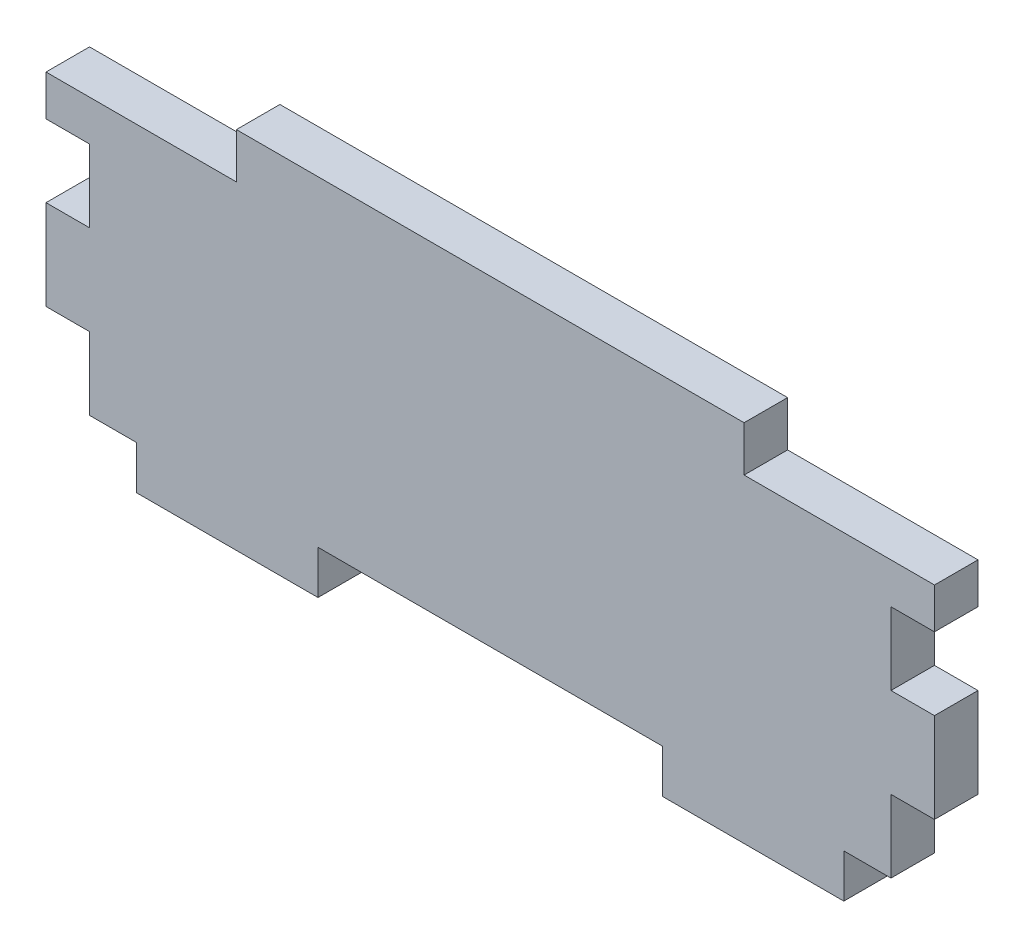
ISO-10303-21;
HEADER;
FILE_DESCRIPTION(('STEP AP214'),'2;1');
FILE_NAME('part.step','',(''),(''),'','','');
FILE_SCHEMA(('AUTOMOTIVE_DESIGN { 1 0 10303 214 1 1 1 1 }'));
ENDSEC;
DATA;
#1=APPLICATION_CONTEXT('core data for automotive mechanical design processes');
#2=APPLICATION_PROTOCOL_DEFINITION('international standard','automotive_design',2000,#1);
#3=PRODUCT_CONTEXT('',#1,'mechanical');
#4=PRODUCT('Part','Part','',(#3));
#5=PRODUCT_RELATED_PRODUCT_CATEGORY('part','',(#4));
#6=PRODUCT_DEFINITION_FORMATION('','',#4);
#7=PRODUCT_DEFINITION_CONTEXT('part definition',#1,'design');
#8=PRODUCT_DEFINITION('design','',#6,#7);
#9=PRODUCT_DEFINITION_SHAPE('','',#8);
#10=(LENGTH_UNIT() NAMED_UNIT(*) SI_UNIT(.MILLI.,.METRE.));
#11=(NAMED_UNIT(*) PLANE_ANGLE_UNIT() SI_UNIT($,.RADIAN.));
#12=(NAMED_UNIT(*) SI_UNIT($,.STERADIAN.) SOLID_ANGLE_UNIT());
#13=UNCERTAINTY_MEASURE_WITH_UNIT(LENGTH_MEASURE(1.E-05),#10,'distance_accuracy_value','');
#14=(GEOMETRIC_REPRESENTATION_CONTEXT(3) GLOBAL_UNCERTAINTY_ASSIGNED_CONTEXT((#13)) GLOBAL_UNIT_ASSIGNED_CONTEXT((#10,
#11,#12)) REPRESENTATION_CONTEXT('',''));
#15=CARTESIAN_POINT('',(0.,0.,0.));
#16=DIRECTION('',(0.,0.,1.));
#17=DIRECTION('',(1.,0.,0.));
#18=AXIS2_PLACEMENT_3D('',#15,#16,#17);
#19=CARTESIAN_POINT('',(3.048,16.1036,3.048));
#20=DIRECTION('',(-1.,0.,0.));
#21=DIRECTION('',(0.,0.,1.));
#22=AXIS2_PLACEMENT_3D('',#19,#20,#21);
#23=PLANE('',#22);
#24=DIRECTION('',(0.,1.,0.));
#25=VECTOR('',#24,1.);
#26=CARTESIAN_POINT('',(3.048,16.1036,0.));
#27=LINE('',#26,#25);
#28=CARTESIAN_POINT('',(3.048,9.80440000000001,0.));
#29=VERTEX_POINT('',#28);
#30=CARTESIAN_POINT('',(3.048,16.1036,0.));
#31=VERTEX_POINT('',#30);
#32=EDGE_CURVE('E249',#29,#31,#27,.T.);
#33=ORIENTED_EDGE('',*,*,#32,.T.);
#34=DIRECTION('',(0.,0.,-1.));
#35=VECTOR('',#34,1.);
#36=CARTESIAN_POINT('',(3.048,16.1036,3.048));
#37=LINE('',#36,#35);
#38=CARTESIAN_POINT('',(3.048,16.1036,3.048));
#39=VERTEX_POINT('',#38);
#40=EDGE_CURVE('E11',#39,#31,#37,.T.);
#41=ORIENTED_EDGE('',*,*,#40,.F.);
#42=DIRECTION('',(0.,1.,0.));
#43=VECTOR('',#42,1.);
#44=CARTESIAN_POINT('',(3.048,16.1036,3.048));
#45=LINE('',#44,#43);
#46=CARTESIAN_POINT('',(3.048,9.80440000000001,3.048));
#47=VERTEX_POINT('',#46);
#48=EDGE_CURVE('E303',#47,#39,#45,.T.);
#49=ORIENTED_EDGE('',*,*,#48,.F.);
#50=DIRECTION('',(0.,0.,-1.));
#51=VECTOR('',#50,1.);
#52=CARTESIAN_POINT('',(3.048,9.80440000000001,3.048));
#53=LINE('',#52,#51);
#54=EDGE_CURVE('E245',#47,#29,#53,.T.);
#55=ORIENTED_EDGE('',*,*,#54,.T.);
#56=EDGE_LOOP('',(#33,#41,#49,#55));
#57=FACE_BOUND('',#56,.T.);
#58=ADVANCED_FACE('F33',(#57),#23,.F.);
#59=CARTESIAN_POINT('',(3.048,16.1036,3.048));
#60=DIRECTION('',(0.,-1.,0.));
#61=DIRECTION('',(0.,0.,-1.));
#62=AXIS2_PLACEMENT_3D('',#59,#60,#61);
#63=PLANE('',#62);
#64=DIRECTION('',(-1.,0.,0.));
#65=VECTOR('',#64,1.);
#66=CARTESIAN_POINT('',(3.048,16.1036,0.));
#67=LINE('',#66,#65);
#68=CARTESIAN_POINT('',(0.,16.1036,0.));
#69=VERTEX_POINT('',#68);
#70=EDGE_CURVE('E252',#31,#69,#67,.T.);
#71=ORIENTED_EDGE('',*,*,#70,.T.);
#72=DIRECTION('',(0.,0.,-1.));
#73=VECTOR('',#72,1.);
#74=CARTESIAN_POINT('',(0.,16.1036,3.048));
#75=LINE('',#74,#73);
#76=CARTESIAN_POINT('',(0.,16.1036,3.048));
#77=VERTEX_POINT('',#76);
#78=EDGE_CURVE('E41',#77,#69,#75,.T.);
#79=ORIENTED_EDGE('',*,*,#78,.F.);
#80=DIRECTION('',(-1.,0.,0.));
#81=VECTOR('',#80,1.);
#82=CARTESIAN_POINT('',(3.048,16.1036,3.048));
#83=LINE('',#82,#81);
#84=EDGE_CURVE('E152',#39,#77,#83,.T.);
#85=ORIENTED_EDGE('',*,*,#84,.F.);
#86=ORIENTED_EDGE('',*,*,#40,.T.);
#87=EDGE_LOOP('',(#71,#79,#85,#86));
#88=FACE_BOUND('',#87,.T.);
#89=ADVANCED_FACE('F461',(#88),#63,.F.);
#90=CARTESIAN_POINT('',(0.,21.1836,3.048));
#91=DIRECTION('',(-1.,0.,0.));
#92=DIRECTION('',(0.,0.,1.));
#93=AXIS2_PLACEMENT_3D('',#90,#91,#92);
#94=PLANE('',#93);
#95=DIRECTION('',(0.,1.,0.));
#96=VECTOR('',#95,1.);
#97=CARTESIAN_POINT('',(0.,21.1836,0.));
#98=LINE('',#97,#96);
#99=CARTESIAN_POINT('',(0.,21.1836,0.));
#100=VERTEX_POINT('',#99);
#101=EDGE_CURVE('E254',#69,#100,#98,.T.);
#102=ORIENTED_EDGE('',*,*,#101,.T.);
#103=DIRECTION('',(0.,0.,-1.));
#104=VECTOR('',#103,1.);
#105=CARTESIAN_POINT('',(0.,21.1836,3.048));
#106=LINE('',#105,#104);
#107=CARTESIAN_POINT('',(0.,21.1836,3.048));
#108=VERTEX_POINT('',#107);
#109=EDGE_CURVE('E370',#108,#100,#106,.T.);
#110=ORIENTED_EDGE('',*,*,#109,.F.);
#111=DIRECTION('',(0.,1.,0.));
#112=VECTOR('',#111,1.);
#113=CARTESIAN_POINT('',(0.,21.1836,3.048));
#114=LINE('',#113,#112);
#115=EDGE_CURVE('E378',#77,#108,#114,.T.);
#116=ORIENTED_EDGE('',*,*,#115,.F.);
#117=ORIENTED_EDGE('',*,*,#78,.T.);
#118=EDGE_LOOP('',(#102,#110,#116,#117));
#119=FACE_BOUND('',#118,.T.);
#120=ADVANCED_FACE('F376',(#119),#94,.F.);
#121=CARTESIAN_POINT('',(3.048,21.1836,3.048));
#122=DIRECTION('',(0.,1.,0.));
#123=DIRECTION('',(0.,0.,1.));
#124=AXIS2_PLACEMENT_3D('',#121,#122,#123);
#125=PLANE('',#124);
#126=DIRECTION('',(1.,0.,0.));
#127=VECTOR('',#126,1.);
#128=CARTESIAN_POINT('',(3.048,21.1836,0.));
#129=LINE('',#128,#127);
#130=CARTESIAN_POINT('',(3.048,21.1836,0.));
#131=VERTEX_POINT('',#130);
#132=EDGE_CURVE('E256',#100,#131,#129,.T.);
#133=ORIENTED_EDGE('',*,*,#132,.T.);
#134=DIRECTION('',(0.,0.,-1.));
#135=VECTOR('',#134,1.);
#136=CARTESIAN_POINT('',(3.048,21.1836,3.048));
#137=LINE('',#136,#135);
#138=CARTESIAN_POINT('',(3.048,21.1836,3.048));
#139=VERTEX_POINT('',#138);
#140=EDGE_CURVE('E367',#139,#131,#137,.T.);
#141=ORIENTED_EDGE('',*,*,#140,.F.);
#142=DIRECTION('',(1.,0.,0.));
#143=VECTOR('',#142,1.);
#144=CARTESIAN_POINT('',(3.048,21.1836,3.048));
#145=LINE('',#144,#143);
#146=EDGE_CURVE('E396',#108,#139,#145,.T.);
#147=ORIENTED_EDGE('',*,*,#146,.F.);
#148=ORIENTED_EDGE('',*,*,#109,.T.);
#149=EDGE_LOOP('',(#133,#141,#147,#148));
#150=FACE_BOUND('',#149,.T.);
#151=ADVANCED_FACE('F387',(#150),#125,.F.);
#152=CARTESIAN_POINT('',(3.048,24.0284,3.048));
#153=DIRECTION('',(-1.,0.,0.));
#154=DIRECTION('',(0.,0.,1.));
#155=AXIS2_PLACEMENT_3D('',#152,#153,#154);
#156=PLANE('',#155);
#157=DIRECTION('',(0.,1.,0.));
#158=VECTOR('',#157,1.);
#159=CARTESIAN_POINT('',(3.048,24.0284,0.));
#160=LINE('',#159,#158);
#161=CARTESIAN_POINT('',(3.048,24.0284,0.));
#162=VERTEX_POINT('',#161);
#163=EDGE_CURVE('E258',#131,#162,#160,.T.);
#164=ORIENTED_EDGE('',*,*,#163,.T.);
#165=DIRECTION('',(0.,0.,-1.));
#166=VECTOR('',#165,1.);
#167=CARTESIAN_POINT('',(3.048,24.0284,3.048));
#168=LINE('',#167,#166);
#169=CARTESIAN_POINT('',(3.048,24.0284,3.048));
#170=VERTEX_POINT('',#169);
#171=EDGE_CURVE('E364',#170,#162,#168,.T.);
#172=ORIENTED_EDGE('',*,*,#171,.F.);
#173=DIRECTION('',(0.,1.,0.));
#174=VECTOR('',#173,1.);
#175=CARTESIAN_POINT('',(3.048,24.0284,3.048));
#176=LINE('',#175,#174);
#177=EDGE_CURVE('E393',#139,#170,#176,.T.);
#178=ORIENTED_EDGE('',*,*,#177,.F.);
#179=ORIENTED_EDGE('',*,*,#140,.T.);
#180=EDGE_LOOP('',(#164,#172,#178,#179));
#181=FACE_BOUND('',#180,.T.);
#182=ADVANCED_FACE('F391',(#181),#156,.F.);
#183=CARTESIAN_POINT('',(3.048,24.0284,3.048));
#184=DIRECTION('',(0.,-1.,0.));
#185=DIRECTION('',(0.,0.,-1.));
#186=AXIS2_PLACEMENT_3D('',#183,#184,#185);
#187=PLANE('',#186);
#188=DIRECTION('',(-1.,0.,0.));
#189=VECTOR('',#188,1.);
#190=CARTESIAN_POINT('',(3.048,24.0284,0.));
#191=LINE('',#190,#189);
#192=CARTESIAN_POINT('',(-10.287,24.0284,0.));
#193=VERTEX_POINT('',#192);
#194=EDGE_CURVE('E260',#162,#193,#191,.T.);
#195=ORIENTED_EDGE('',*,*,#194,.T.);
#196=DIRECTION('',(0.,0.,-1.));
#197=VECTOR('',#196,1.);
#198=CARTESIAN_POINT('',(-10.287,24.0284,3.048));
#199=LINE('',#198,#197);
#200=CARTESIAN_POINT('',(-10.287,24.0284,3.048));
#201=VERTEX_POINT('',#200);
#202=EDGE_CURVE('E361',#201,#193,#199,.T.);
#203=ORIENTED_EDGE('',*,*,#202,.F.);
#204=DIRECTION('',(-1.,0.,0.));
#205=VECTOR('',#204,1.);
#206=CARTESIAN_POINT('',(3.048,24.0284,3.048));
#207=LINE('',#206,#205);
#208=EDGE_CURVE('E395',#170,#201,#207,.T.);
#209=ORIENTED_EDGE('',*,*,#208,.F.);
#210=ORIENTED_EDGE('',*,*,#171,.T.);
#211=EDGE_LOOP('',(#195,#203,#209,#210));
#212=FACE_BOUND('',#211,.T.);
#213=ADVANCED_FACE('F474',(#212),#187,.F.);
#214=CARTESIAN_POINT('',(-10.287,24.0284,3.048));
#215=DIRECTION('',(-1.,0.,0.));
#216=DIRECTION('',(0.,-1.,0.));
#217=AXIS2_PLACEMENT_3D('',#214,#215,#216);
#218=PLANE('',#217);
#219=DIRECTION('',(0.,1.,0.));
#220=VECTOR('',#219,1.);
#221=CARTESIAN_POINT('',(-10.287,24.0284,0.));
#222=LINE('',#221,#220);
#223=CARTESIAN_POINT('',(-10.287,27.2034,0.));
#224=VERTEX_POINT('',#223);
#225=EDGE_CURVE('E262',#193,#224,#222,.T.);
#226=ORIENTED_EDGE('',*,*,#225,.T.);
#227=DIRECTION('',(0.,0.,-1.));
#228=VECTOR('',#227,1.);
#229=CARTESIAN_POINT('',(-10.287,27.2034,3.048));
#230=LINE('',#229,#228);
#231=CARTESIAN_POINT('',(-10.287,27.2034,3.048));
#232=VERTEX_POINT('',#231);
#233=EDGE_CURVE('E358',#232,#224,#230,.T.);
#234=ORIENTED_EDGE('',*,*,#233,.F.);
#235=DIRECTION('',(0.,1.,0.));
#236=VECTOR('',#235,1.);
#237=CARTESIAN_POINT('',(-10.287,24.0284,3.048));
#238=LINE('',#237,#236);
#239=EDGE_CURVE('E398',#201,#232,#238,.T.);
#240=ORIENTED_EDGE('',*,*,#239,.F.);
#241=ORIENTED_EDGE('',*,*,#202,.T.);
#242=EDGE_LOOP('',(#226,#234,#240,#241));
#243=FACE_BOUND('',#242,.T.);
#244=ADVANCED_FACE('F477',(#243),#218,.F.);
#245=CARTESIAN_POINT('',(-10.287,27.2034,3.048));
#246=DIRECTION('',(0.,-1.,0.));
#247=DIRECTION('',(1.,0.,0.));
#248=AXIS2_PLACEMENT_3D('',#245,#246,#247);
#249=PLANE('',#248);
#250=DIRECTION('',(-1.,0.,0.));
#251=VECTOR('',#250,1.);
#252=CARTESIAN_POINT('',(-10.287,27.2034,0.));
#253=LINE('',#252,#251);
#254=CARTESIAN_POINT('',(-45.847,27.2034,0.));
#255=VERTEX_POINT('',#254);
#256=EDGE_CURVE('E264',#224,#255,#253,.T.);
#257=ORIENTED_EDGE('',*,*,#256,.T.);
#258=DIRECTION('',(0.,0.,-1.));
#259=VECTOR('',#258,1.);
#260=CARTESIAN_POINT('',(-45.847,27.2034,3.048));
#261=LINE('',#260,#259);
#262=CARTESIAN_POINT('',(-45.847,27.2034,3.048));
#263=VERTEX_POINT('',#262);
#264=EDGE_CURVE('E355',#263,#255,#261,.T.);
#265=ORIENTED_EDGE('',*,*,#264,.F.);
#266=DIRECTION('',(-1.,0.,0.));
#267=VECTOR('',#266,1.);
#268=CARTESIAN_POINT('',(-10.287,27.2034,3.048));
#269=LINE('',#268,#267);
#270=EDGE_CURVE('E404',#232,#263,#269,.T.);
#271=ORIENTED_EDGE('',*,*,#270,.F.);
#272=ORIENTED_EDGE('',*,*,#233,.T.);
#273=EDGE_LOOP('',(#257,#265,#271,#272));
#274=FACE_BOUND('',#273,.T.);
#275=ADVANCED_FACE('F481',(#274),#249,.F.);
#276=CARTESIAN_POINT('',(-45.847,27.2034,3.048));
#277=DIRECTION('',(1.,0.,0.));
#278=DIRECTION('',(0.,0.,-1.));
#279=AXIS2_PLACEMENT_3D('',#276,#277,#278);
#280=PLANE('',#279);
#281=DIRECTION('',(0.,-1.,0.));
#282=VECTOR('',#281,1.);
#283=CARTESIAN_POINT('',(-45.847,27.2034,0.));
#284=LINE('',#283,#282);
#285=CARTESIAN_POINT('',(-45.847,24.0284,0.));
#286=VERTEX_POINT('',#285);
#287=EDGE_CURVE('E266',#255,#286,#284,.T.);
#288=ORIENTED_EDGE('',*,*,#287,.T.);
#289=DIRECTION('',(0.,0.,-1.));
#290=VECTOR('',#289,1.);
#291=CARTESIAN_POINT('',(-45.847,24.0284,3.048));
#292=LINE('',#291,#290);
#293=CARTESIAN_POINT('',(-45.847,24.0284,3.048));
#294=VERTEX_POINT('',#293);
#295=EDGE_CURVE('E352',#294,#286,#292,.T.);
#296=ORIENTED_EDGE('',*,*,#295,.F.);
#297=DIRECTION('',(0.,-1.,0.));
#298=VECTOR('',#297,1.);
#299=CARTESIAN_POINT('',(-45.847,27.2034,3.048));
#300=LINE('',#299,#298);
#301=EDGE_CURVE('E406',#263,#294,#300,.T.);
#302=ORIENTED_EDGE('',*,*,#301,.F.);
#303=ORIENTED_EDGE('',*,*,#264,.T.);
#304=EDGE_LOOP('',(#288,#296,#302,#303));
#305=FACE_BOUND('',#304,.T.);
#306=ADVANCED_FACE('F485',(#305),#280,.F.);
#307=CARTESIAN_POINT('',(-45.847,24.0284,3.048));
#308=DIRECTION('',(0.,-1.,0.));
#309=DIRECTION('',(1.,0.,0.));
#310=AXIS2_PLACEMENT_3D('',#307,#308,#309);
#311=PLANE('',#310);
#312=DIRECTION('',(-1.,0.,0.));
#313=VECTOR('',#312,1.);
#314=CARTESIAN_POINT('',(-45.847,24.0284,0.));
#315=LINE('',#314,#313);
#316=CARTESIAN_POINT('',(-59.182,24.0284,0.));
#317=VERTEX_POINT('',#316);
#318=EDGE_CURVE('E268',#286,#317,#315,.T.);
#319=ORIENTED_EDGE('',*,*,#318,.T.);
#320=DIRECTION('',(0.,0.,-1.));
#321=VECTOR('',#320,1.);
#322=CARTESIAN_POINT('',(-59.182,24.0284,3.048));
#323=LINE('',#322,#321);
#324=CARTESIAN_POINT('',(-59.182,24.0284,3.048));
#325=VERTEX_POINT('',#324);
#326=EDGE_CURVE('E349',#325,#317,#323,.T.);
#327=ORIENTED_EDGE('',*,*,#326,.F.);
#328=DIRECTION('',(-1.,0.,0.));
#329=VECTOR('',#328,1.);
#330=CARTESIAN_POINT('',(-45.847,24.0284,3.048));
#331=LINE('',#330,#329);
#332=EDGE_CURVE('E408',#294,#325,#331,.T.);
#333=ORIENTED_EDGE('',*,*,#332,.F.);
#334=ORIENTED_EDGE('',*,*,#295,.T.);
#335=EDGE_LOOP('',(#319,#327,#333,#334));
#336=FACE_BOUND('',#335,.T.);
#337=ADVANCED_FACE('F489',(#336),#311,.F.);
#338=CARTESIAN_POINT('',(-59.182,24.0284,3.048));
#339=DIRECTION('',(1.,0.,0.));
#340=DIRECTION('',(0.,0.,-1.));
#341=AXIS2_PLACEMENT_3D('',#338,#339,#340);
#342=PLANE('',#341);
#343=DIRECTION('',(0.,-1.,0.));
#344=VECTOR('',#343,1.);
#345=CARTESIAN_POINT('',(-59.182,24.0284,0.));
#346=LINE('',#345,#344);
#347=CARTESIAN_POINT('',(-59.182,21.1836,0.));
#348=VERTEX_POINT('',#347);
#349=EDGE_CURVE('E270',#317,#348,#346,.T.);
#350=ORIENTED_EDGE('',*,*,#349,.T.);
#351=DIRECTION('',(0.,0.,-1.));
#352=VECTOR('',#351,1.);
#353=CARTESIAN_POINT('',(-59.182,21.1836,3.048));
#354=LINE('',#353,#352);
#355=CARTESIAN_POINT('',(-59.182,21.1836,3.048));
#356=VERTEX_POINT('',#355);
#357=EDGE_CURVE('E346',#356,#348,#354,.T.);
#358=ORIENTED_EDGE('',*,*,#357,.F.);
#359=DIRECTION('',(0.,-1.,0.));
#360=VECTOR('',#359,1.);
#361=CARTESIAN_POINT('',(-59.182,24.0284,3.048));
#362=LINE('',#361,#360);
#363=EDGE_CURVE('E410',#325,#356,#362,.T.);
#364=ORIENTED_EDGE('',*,*,#363,.F.);
#365=ORIENTED_EDGE('',*,*,#326,.T.);
#366=EDGE_LOOP('',(#350,#358,#364,#365));
#367=FACE_BOUND('',#366,.T.);
#368=ADVANCED_FACE('F493',(#367),#342,.F.);
#369=CARTESIAN_POINT('',(-59.182,21.1836,3.048));
#370=DIRECTION('',(0.,1.,0.));
#371=DIRECTION('',(0.,0.,1.));
#372=AXIS2_PLACEMENT_3D('',#369,#370,#371);
#373=PLANE('',#372);
#374=DIRECTION('',(1.,0.,0.));
#375=VECTOR('',#374,1.);
#376=CARTESIAN_POINT('',(-59.182,21.1836,0.));
#377=LINE('',#376,#375);
#378=CARTESIAN_POINT('',(-56.134,21.1836,0.));
#379=VERTEX_POINT('',#378);
#380=EDGE_CURVE('E272',#348,#379,#377,.T.);
#381=ORIENTED_EDGE('',*,*,#380,.T.);
#382=DIRECTION('',(0.,0.,-1.));
#383=VECTOR('',#382,1.);
#384=CARTESIAN_POINT('',(-56.134,21.1836,3.048));
#385=LINE('',#384,#383);
#386=CARTESIAN_POINT('',(-56.134,21.1836,3.048));
#387=VERTEX_POINT('',#386);
#388=EDGE_CURVE('E343',#387,#379,#385,.T.);
#389=ORIENTED_EDGE('',*,*,#388,.F.);
#390=DIRECTION('',(1.,0.,0.));
#391=VECTOR('',#390,1.);
#392=CARTESIAN_POINT('',(-59.182,21.1836,3.048));
#393=LINE('',#392,#391);
#394=EDGE_CURVE('E412',#356,#387,#393,.T.);
#395=ORIENTED_EDGE('',*,*,#394,.F.);
#396=ORIENTED_EDGE('',*,*,#357,.T.);
#397=EDGE_LOOP('',(#381,#389,#395,#396));
#398=FACE_BOUND('',#397,.T.);
#399=ADVANCED_FACE('F497',(#398),#373,.F.);
#400=CARTESIAN_POINT('',(-56.134,21.1836,3.048));
#401=DIRECTION('',(1.,0.,0.));
#402=DIRECTION('',(0.,0.,-1.));
#403=AXIS2_PLACEMENT_3D('',#400,#401,#402);
#404=PLANE('',#403);
#405=DIRECTION('',(0.,-1.,0.));
#406=VECTOR('',#405,1.);
#407=CARTESIAN_POINT('',(-56.134,21.1836,0.));
#408=LINE('',#407,#406);
#409=CARTESIAN_POINT('',(-56.134,16.1036,0.));
#410=VERTEX_POINT('',#409);
#411=EDGE_CURVE('E274',#379,#410,#408,.T.);
#412=ORIENTED_EDGE('',*,*,#411,.T.);
#413=DIRECTION('',(0.,0.,-1.));
#414=VECTOR('',#413,1.);
#415=CARTESIAN_POINT('',(-56.134,16.1036,3.048));
#416=LINE('',#415,#414);
#417=CARTESIAN_POINT('',(-56.134,16.1036,3.048));
#418=VERTEX_POINT('',#417);
#419=EDGE_CURVE('E340',#418,#410,#416,.T.);
#420=ORIENTED_EDGE('',*,*,#419,.F.);
#421=DIRECTION('',(0.,-1.,0.));
#422=VECTOR('',#421,1.);
#423=CARTESIAN_POINT('',(-56.134,21.1836,3.048));
#424=LINE('',#423,#422);
#425=EDGE_CURVE('E414',#387,#418,#424,.T.);
#426=ORIENTED_EDGE('',*,*,#425,.F.);
#427=ORIENTED_EDGE('',*,*,#388,.T.);
#428=EDGE_LOOP('',(#412,#420,#426,#427));
#429=FACE_BOUND('',#428,.T.);
#430=ADVANCED_FACE('F501',(#429),#404,.F.);
#431=CARTESIAN_POINT('',(-59.182,16.1036,3.048));
#432=DIRECTION('',(0.,-1.,0.));
#433=DIRECTION('',(0.,0.,-1.));
#434=AXIS2_PLACEMENT_3D('',#431,#432,#433);
#435=PLANE('',#434);
#436=DIRECTION('',(-1.,0.,0.));
#437=VECTOR('',#436,1.);
#438=CARTESIAN_POINT('',(-59.182,16.1036,0.));
#439=LINE('',#438,#437);
#440=CARTESIAN_POINT('',(-59.182,16.1036,0.));
#441=VERTEX_POINT('',#440);
#442=EDGE_CURVE('E276',#410,#441,#439,.T.);
#443=ORIENTED_EDGE('',*,*,#442,.T.);
#444=DIRECTION('',(0.,0.,-1.));
#445=VECTOR('',#444,1.);
#446=CARTESIAN_POINT('',(-59.182,16.1036,3.048));
#447=LINE('',#446,#445);
#448=CARTESIAN_POINT('',(-59.182,16.1036,3.048));
#449=VERTEX_POINT('',#448);
#450=EDGE_CURVE('E337',#449,#441,#447,.T.);
#451=ORIENTED_EDGE('',*,*,#450,.F.);
#452=DIRECTION('',(-1.,0.,0.));
#453=VECTOR('',#452,1.);
#454=CARTESIAN_POINT('',(-59.182,16.1036,3.048));
#455=LINE('',#454,#453);
#456=EDGE_CURVE('E416',#418,#449,#455,.T.);
#457=ORIENTED_EDGE('',*,*,#456,.F.);
#458=ORIENTED_EDGE('',*,*,#419,.T.);
#459=EDGE_LOOP('',(#443,#451,#457,#458));
#460=FACE_BOUND('',#459,.T.);
#461=ADVANCED_FACE('F505',(#460),#435,.F.);
#462=CARTESIAN_POINT('',(-59.182,16.1036,3.048));
#463=DIRECTION('',(1.,0.,0.));
#464=DIRECTION('',(0.,1.,0.));
#465=AXIS2_PLACEMENT_3D('',#462,#463,#464);
#466=PLANE('',#465);
#467=DIRECTION('',(0.,-1.,0.));
#468=VECTOR('',#467,1.);
#469=CARTESIAN_POINT('',(-59.182,16.1036,0.));
#470=LINE('',#469,#468);
#471=CARTESIAN_POINT('',(-59.182,9.80439999999999,0.));
#472=VERTEX_POINT('',#471);
#473=EDGE_CURVE('E278',#441,#472,#470,.T.);
#474=ORIENTED_EDGE('',*,*,#473,.T.);
#475=DIRECTION('',(0.,0.,-1.));
#476=VECTOR('',#475,1.);
#477=CARTESIAN_POINT('',(-59.182,9.80439999999999,3.048));
#478=LINE('',#477,#476);
#479=CARTESIAN_POINT('',(-59.182,9.80439999999999,3.048));
#480=VERTEX_POINT('',#479);
#481=EDGE_CURVE('E334',#480,#472,#478,.T.);
#482=ORIENTED_EDGE('',*,*,#481,.F.);
#483=DIRECTION('',(0.,-1.,0.));
#484=VECTOR('',#483,1.);
#485=CARTESIAN_POINT('',(-59.182,16.1036,3.048));
#486=LINE('',#485,#484);
#487=EDGE_CURVE('E418',#449,#480,#486,.T.);
#488=ORIENTED_EDGE('',*,*,#487,.F.);
#489=ORIENTED_EDGE('',*,*,#450,.T.);
#490=EDGE_LOOP('',(#474,#482,#488,#489));
#491=FACE_BOUND('',#490,.T.);
#492=ADVANCED_FACE('F509',(#491),#466,.F.);
#493=CARTESIAN_POINT('',(-59.182,9.80439999999999,3.048));
#494=DIRECTION('',(0.,1.,0.));
#495=DIRECTION('',(0.,0.,1.));
#496=AXIS2_PLACEMENT_3D('',#493,#494,#495);
#497=PLANE('',#496);
#498=DIRECTION('',(1.,0.,0.));
#499=VECTOR('',#498,1.);
#500=CARTESIAN_POINT('',(-59.182,9.80439999999999,0.));
#501=LINE('',#500,#499);
#502=CARTESIAN_POINT('',(-56.134,9.80439999999999,0.));
#503=VERTEX_POINT('',#502);
#504=EDGE_CURVE('E280',#472,#503,#501,.T.);
#505=ORIENTED_EDGE('',*,*,#504,.T.);
#506=DIRECTION('',(0.,0.,-1.));
#507=VECTOR('',#506,1.);
#508=CARTESIAN_POINT('',(-56.134,9.80439999999999,3.048));
#509=LINE('',#508,#507);
#510=CARTESIAN_POINT('',(-56.134,9.80439999999999,3.048));
#511=VERTEX_POINT('',#510);
#512=EDGE_CURVE('E331',#511,#503,#509,.T.);
#513=ORIENTED_EDGE('',*,*,#512,.F.);
#514=DIRECTION('',(1.,0.,0.));
#515=VECTOR('',#514,1.);
#516=CARTESIAN_POINT('',(-59.182,9.80439999999999,3.048));
#517=LINE('',#516,#515);
#518=EDGE_CURVE('E420',#480,#511,#517,.T.);
#519=ORIENTED_EDGE('',*,*,#518,.F.);
#520=ORIENTED_EDGE('',*,*,#481,.T.);
#521=EDGE_LOOP('',(#505,#513,#519,#520));
#522=FACE_BOUND('',#521,.T.);
#523=ADVANCED_FACE('F513',(#522),#497,.F.);
#524=CARTESIAN_POINT('',(-56.134,9.80439999999999,3.048));
#525=DIRECTION('',(1.,0.,0.));
#526=DIRECTION('',(0.,0.,-1.));
#527=AXIS2_PLACEMENT_3D('',#524,#525,#526);
#528=PLANE('',#527);
#529=DIRECTION('',(0.,-1.,0.));
#530=VECTOR('',#529,1.);
#531=CARTESIAN_POINT('',(-56.134,9.80439999999999,0.));
#532=LINE('',#531,#530);
#533=CARTESIAN_POINT('',(-56.134,4.72439999999999,0.));
#534=VERTEX_POINT('',#533);
#535=EDGE_CURVE('E282',#503,#534,#532,.T.);
#536=ORIENTED_EDGE('',*,*,#535,.T.);
#537=DIRECTION('',(0.,0.,-1.));
#538=VECTOR('',#537,1.);
#539=CARTESIAN_POINT('',(-56.134,4.72439999999999,3.048));
#540=LINE('',#539,#538);
#541=CARTESIAN_POINT('',(-56.134,4.72439999999999,3.048));
#542=VERTEX_POINT('',#541);
#543=EDGE_CURVE('E328',#542,#534,#540,.T.);
#544=ORIENTED_EDGE('',*,*,#543,.F.);
#545=DIRECTION('',(0.,-1.,0.));
#546=VECTOR('',#545,1.);
#547=CARTESIAN_POINT('',(-56.134,9.80439999999999,3.048));
#548=LINE('',#547,#546);
#549=EDGE_CURVE('E422',#511,#542,#548,.T.);
#550=ORIENTED_EDGE('',*,*,#549,.F.);
#551=ORIENTED_EDGE('',*,*,#512,.T.);
#552=EDGE_LOOP('',(#536,#544,#550,#551));
#553=FACE_BOUND('',#552,.T.);
#554=ADVANCED_FACE('F517',(#553),#528,.F.);
#555=CARTESIAN_POINT('',(-52.832,4.72439999999999,3.048));
#556=DIRECTION('',(0.,1.,0.));
#557=DIRECTION('',(0.,0.,1.));
#558=AXIS2_PLACEMENT_3D('',#555,#556,#557);
#559=PLANE('',#558);
#560=DIRECTION('',(1.,0.,0.));
#561=VECTOR('',#560,1.);
#562=CARTESIAN_POINT('',(-52.832,4.72439999999999,0.));
#563=LINE('',#562,#561);
#564=CARTESIAN_POINT('',(-52.832,4.72439999999999,0.));
#565=VERTEX_POINT('',#564);
#566=EDGE_CURVE('E284',#534,#565,#563,.T.);
#567=ORIENTED_EDGE('',*,*,#566,.T.);
#568=DIRECTION('',(0.,0.,-1.));
#569=VECTOR('',#568,1.);
#570=CARTESIAN_POINT('',(-52.832,4.72439999999999,3.048));
#571=LINE('',#570,#569);
#572=CARTESIAN_POINT('',(-52.832,4.72439999999999,3.048));
#573=VERTEX_POINT('',#572);
#574=EDGE_CURVE('E325',#573,#565,#571,.T.);
#575=ORIENTED_EDGE('',*,*,#574,.F.);
#576=DIRECTION('',(1.,0.,0.));
#577=VECTOR('',#576,1.);
#578=CARTESIAN_POINT('',(-52.832,4.72439999999999,3.048));
#579=LINE('',#578,#577);
#580=EDGE_CURVE('E424',#542,#573,#579,.T.);
#581=ORIENTED_EDGE('',*,*,#580,.F.);
#582=ORIENTED_EDGE('',*,*,#543,.T.);
#583=EDGE_LOOP('',(#567,#575,#581,#582));
#584=FACE_BOUND('',#583,.T.);
#585=ADVANCED_FACE('F521',(#584),#559,.F.);
#586=CARTESIAN_POINT('',(-52.832,1.67639999999999,3.048));
#587=DIRECTION('',(1.,0.,0.));
#588=DIRECTION('',(0.,0.,-1.));
#589=AXIS2_PLACEMENT_3D('',#586,#587,#588);
#590=PLANE('',#589);
#591=DIRECTION('',(0.,-1.,0.));
#592=VECTOR('',#591,1.);
#593=CARTESIAN_POINT('',(-52.832,1.67639999999999,0.));
#594=LINE('',#593,#592);
#595=CARTESIAN_POINT('',(-52.832,1.67639999999999,0.));
#596=VERTEX_POINT('',#595);
#597=EDGE_CURVE('E286',#565,#596,#594,.T.);
#598=ORIENTED_EDGE('',*,*,#597,.T.);
#599=DIRECTION('',(0.,0.,-1.));
#600=VECTOR('',#599,1.);
#601=CARTESIAN_POINT('',(-52.832,1.67639999999999,3.048));
#602=LINE('',#601,#600);
#603=CARTESIAN_POINT('',(-52.832,1.67639999999999,3.048));
#604=VERTEX_POINT('',#603);
#605=EDGE_CURVE('E322',#604,#596,#602,.T.);
#606=ORIENTED_EDGE('',*,*,#605,.F.);
#607=DIRECTION('',(0.,-1.,0.));
#608=VECTOR('',#607,1.);
#609=CARTESIAN_POINT('',(-52.832,1.67639999999999,3.048));
#610=LINE('',#609,#608);
#611=EDGE_CURVE('E426',#573,#604,#610,.T.);
#612=ORIENTED_EDGE('',*,*,#611,.F.);
#613=ORIENTED_EDGE('',*,*,#574,.T.);
#614=EDGE_LOOP('',(#598,#606,#612,#613));
#615=FACE_BOUND('',#614,.T.);
#616=ADVANCED_FACE('F525',(#615),#590,.F.);
#617=CARTESIAN_POINT('',(-40.132,1.6764,3.048));
#618=DIRECTION('',(0.,1.,0.));
#619=DIRECTION('',(-1.,0.,0.));
#620=AXIS2_PLACEMENT_3D('',#617,#618,#619);
#621=PLANE('',#620);
#622=DIRECTION('',(1.,0.,0.));
#623=VECTOR('',#622,1.);
#624=CARTESIAN_POINT('',(-40.132,1.6764,0.));
#625=LINE('',#624,#623);
#626=CARTESIAN_POINT('',(-40.132,1.6764,0.));
#627=VERTEX_POINT('',#626);
#628=EDGE_CURVE('E288',#596,#627,#625,.T.);
#629=ORIENTED_EDGE('',*,*,#628,.T.);
#630=DIRECTION('',(0.,0.,-1.));
#631=VECTOR('',#630,1.);
#632=CARTESIAN_POINT('',(-40.132,1.6764,3.048));
#633=LINE('',#632,#631);
#634=CARTESIAN_POINT('',(-40.132,1.6764,3.048));
#635=VERTEX_POINT('',#634);
#636=EDGE_CURVE('E319',#635,#627,#633,.T.);
#637=ORIENTED_EDGE('',*,*,#636,.F.);
#638=DIRECTION('',(1.,0.,0.));
#639=VECTOR('',#638,1.);
#640=CARTESIAN_POINT('',(-40.132,1.6764,3.048));
#641=LINE('',#640,#639);
#642=EDGE_CURVE('E428',#604,#635,#641,.T.);
#643=ORIENTED_EDGE('',*,*,#642,.F.);
#644=ORIENTED_EDGE('',*,*,#605,.T.);
#645=EDGE_LOOP('',(#629,#637,#643,#644));
#646=FACE_BOUND('',#645,.T.);
#647=ADVANCED_FACE('F529',(#646),#621,.F.);
#648=CARTESIAN_POINT('',(-40.132,4.72439999999999,3.048));
#649=DIRECTION('',(-1.,0.,0.));
#650=DIRECTION('',(0.,0.,1.));
#651=AXIS2_PLACEMENT_3D('',#648,#649,#650);
#652=PLANE('',#651);
#653=DIRECTION('',(0.,1.,0.));
#654=VECTOR('',#653,1.);
#655=CARTESIAN_POINT('',(-40.132,4.72439999999999,0.));
#656=LINE('',#655,#654);
#657=CARTESIAN_POINT('',(-40.132,4.72439999999999,0.));
#658=VERTEX_POINT('',#657);
#659=EDGE_CURVE('E290',#627,#658,#656,.T.);
#660=ORIENTED_EDGE('',*,*,#659,.T.);
#661=DIRECTION('',(0.,0.,-1.));
#662=VECTOR('',#661,1.);
#663=CARTESIAN_POINT('',(-40.132,4.72439999999999,3.048));
#664=LINE('',#663,#662);
#665=CARTESIAN_POINT('',(-40.132,4.72439999999999,3.048));
#666=VERTEX_POINT('',#665);
#667=EDGE_CURVE('E316',#666,#658,#664,.T.);
#668=ORIENTED_EDGE('',*,*,#667,.F.);
#669=DIRECTION('',(0.,1.,0.));
#670=VECTOR('',#669,1.);
#671=CARTESIAN_POINT('',(-40.132,4.72439999999999,3.048));
#672=LINE('',#671,#670);
#673=EDGE_CURVE('E430',#635,#666,#672,.T.);
#674=ORIENTED_EDGE('',*,*,#673,.F.);
#675=ORIENTED_EDGE('',*,*,#636,.T.);
#676=EDGE_LOOP('',(#660,#668,#674,#675));
#677=FACE_BOUND('',#676,.T.);
#678=ADVANCED_FACE('F533',(#677),#652,.F.);
#679=CARTESIAN_POINT('',(-16.002,4.7244,3.048));
#680=DIRECTION('',(0.,1.,0.));
#681=DIRECTION('',(-1.,0.,0.));
#682=AXIS2_PLACEMENT_3D('',#679,#680,#681);
#683=PLANE('',#682);
#684=DIRECTION('',(1.,0.,0.));
#685=VECTOR('',#684,1.);
#686=CARTESIAN_POINT('',(-16.002,4.7244,0.));
#687=LINE('',#686,#685);
#688=CARTESIAN_POINT('',(-16.002,4.7244,0.));
#689=VERTEX_POINT('',#688);
#690=EDGE_CURVE('E292',#658,#689,#687,.T.);
#691=ORIENTED_EDGE('',*,*,#690,.T.);
#692=DIRECTION('',(0.,0.,-1.));
#693=VECTOR('',#692,1.);
#694=CARTESIAN_POINT('',(-16.002,4.7244,3.048));
#695=LINE('',#694,#693);
#696=CARTESIAN_POINT('',(-16.002,4.7244,3.048));
#697=VERTEX_POINT('',#696);
#698=EDGE_CURVE('E313',#697,#689,#695,.T.);
#699=ORIENTED_EDGE('',*,*,#698,.F.);
#700=DIRECTION('',(1.,0.,0.));
#701=VECTOR('',#700,1.);
#702=CARTESIAN_POINT('',(-16.002,4.7244,3.048));
#703=LINE('',#702,#701);
#704=EDGE_CURVE('E432',#666,#697,#703,.T.);
#705=ORIENTED_EDGE('',*,*,#704,.F.);
#706=ORIENTED_EDGE('',*,*,#667,.T.);
#707=EDGE_LOOP('',(#691,#699,#705,#706));
#708=FACE_BOUND('',#707,.T.);
#709=ADVANCED_FACE('F537',(#708),#683,.F.);
#710=CARTESIAN_POINT('',(-16.002,1.6764,3.048));
#711=DIRECTION('',(1.,0.,0.));
#712=DIRECTION('',(0.,1.,0.));
#713=AXIS2_PLACEMENT_3D('',#710,#711,#712);
#714=PLANE('',#713);
#715=DIRECTION('',(0.,-1.,0.));
#716=VECTOR('',#715,1.);
#717=CARTESIAN_POINT('',(-16.002,1.6764,0.));
#718=LINE('',#717,#716);
#719=CARTESIAN_POINT('',(-16.002,1.6764,0.));
#720=VERTEX_POINT('',#719);
#721=EDGE_CURVE('E294',#689,#720,#718,.T.);
#722=ORIENTED_EDGE('',*,*,#721,.T.);
#723=DIRECTION('',(0.,0.,-1.));
#724=VECTOR('',#723,1.);
#725=CARTESIAN_POINT('',(-16.002,1.6764,3.048));
#726=LINE('',#725,#724);
#727=CARTESIAN_POINT('',(-16.002,1.6764,3.048));
#728=VERTEX_POINT('',#727);
#729=EDGE_CURVE('E310',#728,#720,#726,.T.);
#730=ORIENTED_EDGE('',*,*,#729,.F.);
#731=DIRECTION('',(0.,-1.,0.));
#732=VECTOR('',#731,1.);
#733=CARTESIAN_POINT('',(-16.002,1.6764,3.048));
#734=LINE('',#733,#732);
#735=EDGE_CURVE('E434',#697,#728,#734,.T.);
#736=ORIENTED_EDGE('',*,*,#735,.F.);
#737=ORIENTED_EDGE('',*,*,#698,.T.);
#738=EDGE_LOOP('',(#722,#730,#736,#737));
#739=FACE_BOUND('',#738,.T.);
#740=ADVANCED_FACE('F541',(#739),#714,.F.);
#741=CARTESIAN_POINT('',(-3.302,1.6764,3.048));
#742=DIRECTION('',(0.,1.,0.));
#743=DIRECTION('',(-1.,0.,0.));
#744=AXIS2_PLACEMENT_3D('',#741,#742,#743);
#745=PLANE('',#744);
#746=DIRECTION('',(1.,0.,0.));
#747=VECTOR('',#746,1.);
#748=CARTESIAN_POINT('',(-3.302,1.6764,0.));
#749=LINE('',#748,#747);
#750=CARTESIAN_POINT('',(-3.302,1.6764,0.));
#751=VERTEX_POINT('',#750);
#752=EDGE_CURVE('E296',#720,#751,#749,.T.);
#753=ORIENTED_EDGE('',*,*,#752,.T.);
#754=DIRECTION('',(0.,0.,-1.));
#755=VECTOR('',#754,1.);
#756=CARTESIAN_POINT('',(-3.302,1.6764,3.048));
#757=LINE('',#756,#755);
#758=CARTESIAN_POINT('',(-3.302,1.6764,3.048));
#759=VERTEX_POINT('',#758);
#760=EDGE_CURVE('E307',#759,#751,#757,.T.);
#761=ORIENTED_EDGE('',*,*,#760,.F.);
#762=DIRECTION('',(1.,0.,0.));
#763=VECTOR('',#762,1.);
#764=CARTESIAN_POINT('',(-3.302,1.6764,3.048));
#765=LINE('',#764,#763);
#766=EDGE_CURVE('E436',#728,#759,#765,.T.);
#767=ORIENTED_EDGE('',*,*,#766,.F.);
#768=ORIENTED_EDGE('',*,*,#729,.T.);
#769=EDGE_LOOP('',(#753,#761,#767,#768));
#770=FACE_BOUND('',#769,.T.);
#771=ADVANCED_FACE('F442',(#770),#745,.F.);
#772=CARTESIAN_POINT('',(-3.302,4.7244,3.048));
#773=DIRECTION('',(-1.,0.,0.));
#774=DIRECTION('',(0.,-1.,0.));
#775=AXIS2_PLACEMENT_3D('',#772,#773,#774);
#776=PLANE('',#775);
#777=DIRECTION('',(0.,1.,0.));
#778=VECTOR('',#777,1.);
#779=CARTESIAN_POINT('',(-3.302,4.7244,0.));
#780=LINE('',#779,#778);
#781=CARTESIAN_POINT('',(-3.302,4.7244,0.));
#782=VERTEX_POINT('',#781);
#783=EDGE_CURVE('E298',#751,#782,#780,.T.);
#784=ORIENTED_EDGE('',*,*,#783,.T.);
#785=DIRECTION('',(0.,0.,-1.));
#786=VECTOR('',#785,1.);
#787=CARTESIAN_POINT('',(-3.302,4.7244,3.048));
#788=LINE('',#787,#786);
#789=CARTESIAN_POINT('',(-3.302,4.7244,3.048));
#790=VERTEX_POINT('',#789);
#791=EDGE_CURVE('E240',#790,#782,#788,.T.);
#792=ORIENTED_EDGE('',*,*,#791,.F.);
#793=DIRECTION('',(0.,1.,0.));
#794=VECTOR('',#793,1.);
#795=CARTESIAN_POINT('',(-3.302,4.7244,3.048));
#796=LINE('',#795,#794);
#797=EDGE_CURVE('E231',#759,#790,#796,.T.);
#798=ORIENTED_EDGE('',*,*,#797,.F.);
#799=ORIENTED_EDGE('',*,*,#760,.T.);
#800=EDGE_LOOP('',(#784,#792,#798,#799));
#801=FACE_BOUND('',#800,.T.);
#802=ADVANCED_FACE('F446',(#801),#776,.F.);
#803=CARTESIAN_POINT('',(0.,4.7244,3.048));
#804=DIRECTION('',(0.,1.,0.));
#805=DIRECTION('',(-1.,0.,0.));
#806=AXIS2_PLACEMENT_3D('',#803,#804,#805);
#807=PLANE('',#806);
#808=DIRECTION('',(1.,0.,0.));
#809=VECTOR('',#808,1.);
#810=CARTESIAN_POINT('',(0.,4.7244,0.));
#811=LINE('',#810,#809);
#812=CARTESIAN_POINT('',(0.,4.7244,0.));
#813=VERTEX_POINT('',#812);
#814=EDGE_CURVE('E239',#782,#813,#811,.T.);
#815=ORIENTED_EDGE('',*,*,#814,.T.);
#816=DIRECTION('',(0.,0.,-1.));
#817=VECTOR('',#816,1.);
#818=CARTESIAN_POINT('',(0.,4.7244,3.048));
#819=LINE('',#818,#817);
#820=CARTESIAN_POINT('',(0.,4.7244,3.048));
#821=VERTEX_POINT('',#820);
#822=EDGE_CURVE('E236',#821,#813,#819,.T.);
#823=ORIENTED_EDGE('',*,*,#822,.F.);
#824=DIRECTION('',(1.,0.,0.));
#825=VECTOR('',#824,1.);
#826=CARTESIAN_POINT('',(0.,4.7244,3.048));
#827=LINE('',#826,#825);
#828=EDGE_CURVE('E225',#790,#821,#827,.T.);
#829=ORIENTED_EDGE('',*,*,#828,.F.);
#830=ORIENTED_EDGE('',*,*,#791,.T.);
#831=EDGE_LOOP('',(#815,#823,#829,#830));
#832=FACE_BOUND('',#831,.T.);
#833=ADVANCED_FACE('F237',(#832),#807,.F.);
#834=CARTESIAN_POINT('',(0.,9.80440000000001,3.048));
#835=DIRECTION('',(-1.,0.,0.));
#836=DIRECTION('',(0.,0.,1.));
#837=AXIS2_PLACEMENT_3D('',#834,#835,#836);
#838=PLANE('',#837);
#839=DIRECTION('',(0.,1.,0.));
#840=VECTOR('',#839,1.);
#841=CARTESIAN_POINT('',(0.,9.80440000000001,0.));
#842=LINE('',#841,#840);
#843=CARTESIAN_POINT('',(0.,9.80440000000001,0.));
#844=VERTEX_POINT('',#843);
#845=EDGE_CURVE('E138',#813,#844,#842,.T.);
#846=ORIENTED_EDGE('',*,*,#845,.T.);
#847=DIRECTION('',(0.,0.,-1.));
#848=VECTOR('',#847,1.);
#849=CARTESIAN_POINT('',(0.,9.80440000000001,3.048));
#850=LINE('',#849,#848);
#851=CARTESIAN_POINT('',(0.,9.80440000000001,3.048));
#852=VERTEX_POINT('',#851);
#853=EDGE_CURVE('E241',#852,#844,#850,.T.);
#854=ORIENTED_EDGE('',*,*,#853,.F.);
#855=DIRECTION('',(0.,1.,0.));
#856=VECTOR('',#855,1.);
#857=CARTESIAN_POINT('',(0.,9.80440000000001,3.048));
#858=LINE('',#857,#856);
#859=EDGE_CURVE('E229',#821,#852,#858,.T.);
#860=ORIENTED_EDGE('',*,*,#859,.F.);
#861=ORIENTED_EDGE('',*,*,#822,.T.);
#862=EDGE_LOOP('',(#846,#854,#860,#861));
#863=FACE_BOUND('',#862,.T.);
#864=ADVANCED_FACE('F243',(#863),#838,.F.);
#865=CARTESIAN_POINT('',(3.048,9.80440000000001,3.048));
#866=DIRECTION('',(0.,1.,0.));
#867=DIRECTION('',(0.,0.,1.));
#868=AXIS2_PLACEMENT_3D('',#865,#866,#867);
#869=PLANE('',#868);
#870=DIRECTION('',(1.,0.,0.));
#871=VECTOR('',#870,1.);
#872=CARTESIAN_POINT('',(3.048,9.80440000000001,0.));
#873=LINE('',#872,#871);
#874=EDGE_CURVE('E144',#844,#29,#873,.T.);
#875=ORIENTED_EDGE('',*,*,#874,.T.);
#876=ORIENTED_EDGE('',*,*,#54,.F.);
#877=DIRECTION('',(1.,0.,0.));
#878=VECTOR('',#877,1.);
#879=CARTESIAN_POINT('',(3.048,9.80440000000001,3.048));
#880=LINE('',#879,#878);
#881=EDGE_CURVE('E49',#852,#47,#880,.T.);
#882=ORIENTED_EDGE('',*,*,#881,.F.);
#883=ORIENTED_EDGE('',*,*,#853,.T.);
#884=EDGE_LOOP('',(#875,#876,#882,#883));
#885=FACE_BOUND('',#884,.T.);
#886=ADVANCED_FACE('F450',(#885),#869,.F.);
#887=CARTESIAN_POINT('',(0.,0.,3.048));
#888=DIRECTION('',(0.,0.,-1.));
#889=DIRECTION('',(-1.,0.,0.));
#890=AXIS2_PLACEMENT_3D('',#887,#888,#889);
#891=PLANE('',#890);
#892=ORIENTED_EDGE('',*,*,#48,.T.);
#893=ORIENTED_EDGE('',*,*,#84,.T.);
#894=ORIENTED_EDGE('',*,*,#115,.T.);
#895=ORIENTED_EDGE('',*,*,#146,.T.);
#896=ORIENTED_EDGE('',*,*,#177,.T.);
#897=ORIENTED_EDGE('',*,*,#208,.T.);
#898=ORIENTED_EDGE('',*,*,#239,.T.);
#899=ORIENTED_EDGE('',*,*,#270,.T.);
#900=ORIENTED_EDGE('',*,*,#301,.T.);
#901=ORIENTED_EDGE('',*,*,#332,.T.);
#902=ORIENTED_EDGE('',*,*,#363,.T.);
#903=ORIENTED_EDGE('',*,*,#394,.T.);
#904=ORIENTED_EDGE('',*,*,#425,.T.);
#905=ORIENTED_EDGE('',*,*,#456,.T.);
#906=ORIENTED_EDGE('',*,*,#487,.T.);
#907=ORIENTED_EDGE('',*,*,#518,.T.);
#908=ORIENTED_EDGE('',*,*,#549,.T.);
#909=ORIENTED_EDGE('',*,*,#580,.T.);
#910=ORIENTED_EDGE('',*,*,#611,.T.);
#911=ORIENTED_EDGE('',*,*,#642,.T.);
#912=ORIENTED_EDGE('',*,*,#673,.T.);
#913=ORIENTED_EDGE('',*,*,#704,.T.);
#914=ORIENTED_EDGE('',*,*,#735,.T.);
#915=ORIENTED_EDGE('',*,*,#766,.T.);
#916=ORIENTED_EDGE('',*,*,#797,.T.);
#917=ORIENTED_EDGE('',*,*,#828,.T.);
#918=ORIENTED_EDGE('',*,*,#859,.T.);
#919=ORIENTED_EDGE('',*,*,#881,.T.);
#920=EDGE_LOOP('',(#892,#893,#894,#895,#896,#897,#898,#899,#900,#901,#902,#903,#904,#905,#906,
#907,#908,#909,#910,#911,#912,#913,#914,#915,#916,#917,#918,#919));
#921=FACE_BOUND('',#920,.T.);
#922=ADVANCED_FACE('F227',(#921),#891,.F.);
#923=CARTESIAN_POINT('',(0.,0.,0.));
#924=DIRECTION('',(0.,0.,-1.));
#925=DIRECTION('',(-1.,0.,0.));
#926=AXIS2_PLACEMENT_3D('',#923,#924,#925);
#927=PLANE('',#926);
#928=ORIENTED_EDGE('',*,*,#32,.F.);
#929=ORIENTED_EDGE('',*,*,#874,.F.);
#930=ORIENTED_EDGE('',*,*,#845,.F.);
#931=ORIENTED_EDGE('',*,*,#814,.F.);
#932=ORIENTED_EDGE('',*,*,#783,.F.);
#933=ORIENTED_EDGE('',*,*,#752,.F.);
#934=ORIENTED_EDGE('',*,*,#721,.F.);
#935=ORIENTED_EDGE('',*,*,#690,.F.);
#936=ORIENTED_EDGE('',*,*,#659,.F.);
#937=ORIENTED_EDGE('',*,*,#628,.F.);
#938=ORIENTED_EDGE('',*,*,#597,.F.);
#939=ORIENTED_EDGE('',*,*,#566,.F.);
#940=ORIENTED_EDGE('',*,*,#535,.F.);
#941=ORIENTED_EDGE('',*,*,#504,.F.);
#942=ORIENTED_EDGE('',*,*,#473,.F.);
#943=ORIENTED_EDGE('',*,*,#442,.F.);
#944=ORIENTED_EDGE('',*,*,#411,.F.);
#945=ORIENTED_EDGE('',*,*,#380,.F.);
#946=ORIENTED_EDGE('',*,*,#349,.F.);
#947=ORIENTED_EDGE('',*,*,#318,.F.);
#948=ORIENTED_EDGE('',*,*,#287,.F.);
#949=ORIENTED_EDGE('',*,*,#256,.F.);
#950=ORIENTED_EDGE('',*,*,#225,.F.);
#951=ORIENTED_EDGE('',*,*,#194,.F.);
#952=ORIENTED_EDGE('',*,*,#163,.F.);
#953=ORIENTED_EDGE('',*,*,#132,.F.);
#954=ORIENTED_EDGE('',*,*,#101,.F.);
#955=ORIENTED_EDGE('',*,*,#70,.F.);
#956=EDGE_LOOP('',(#928,#929,#930,#931,#932,#933,#934,#935,#936,#937,#938,#939,#940,#941,#942,
#943,#944,#945,#946,#947,#948,#949,#950,#951,#952,#953,#954,#955));
#957=FACE_BOUND('',#956,.T.);
#958=ADVANCED_FACE('F382',(#957),#927,.T.);
#959=CLOSED_SHELL('',(#58,#89,#120,#151,#182,#213,#244,#275,#306,#337,#368,#399,#430,#461,#492,
#523,#554,#585,#616,#647,#678,#709,#740,#771,#802,#833,#864,#886,#922,#958));
#960=MANIFOLD_SOLID_BREP('B2',#959);
#961=ADVANCED_BREP_SHAPE_REPRESENTATION('',(#18,#960),#14);
#962=SHAPE_DEFINITION_REPRESENTATION(#9,#961);
ENDSEC;
END-ISO-10303-21;
